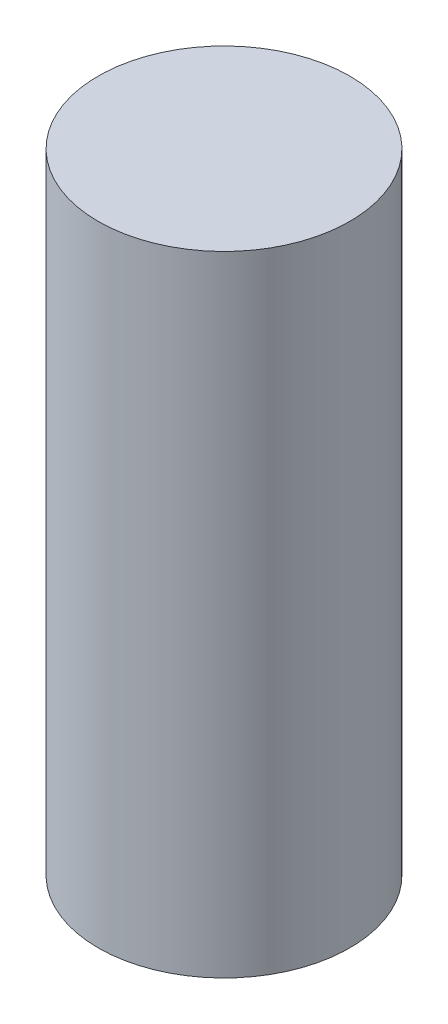
ISO-10303-21;
HEADER;
FILE_DESCRIPTION(('STEP AP214'),'2;1');
FILE_NAME('part.step','',(''),(''),'','','');
FILE_SCHEMA(('AUTOMOTIVE_DESIGN { 1 0 10303 214 1 1 1 1 }'));
ENDSEC;
DATA;
#1=APPLICATION_CONTEXT('core data for automotive mechanical design processes');
#2=APPLICATION_PROTOCOL_DEFINITION('international standard','automotive_design',2000,#1);
#3=PRODUCT_CONTEXT('',#1,'mechanical');
#4=PRODUCT('Part','Part','',(#3));
#5=PRODUCT_RELATED_PRODUCT_CATEGORY('part','',(#4));
#6=PRODUCT_DEFINITION_FORMATION('','',#4);
#7=PRODUCT_DEFINITION_CONTEXT('part definition',#1,'design');
#8=PRODUCT_DEFINITION('design','',#6,#7);
#9=PRODUCT_DEFINITION_SHAPE('','',#8);
#10=(LENGTH_UNIT() NAMED_UNIT(*) SI_UNIT(.MILLI.,.METRE.));
#11=(NAMED_UNIT(*) PLANE_ANGLE_UNIT() SI_UNIT($,.RADIAN.));
#12=(NAMED_UNIT(*) SI_UNIT($,.STERADIAN.) SOLID_ANGLE_UNIT());
#13=UNCERTAINTY_MEASURE_WITH_UNIT(LENGTH_MEASURE(1.E-05),#10,'distance_accuracy_value','');
#14=(GEOMETRIC_REPRESENTATION_CONTEXT(3) GLOBAL_UNCERTAINTY_ASSIGNED_CONTEXT((#13)) GLOBAL_UNIT_ASSIGNED_CONTEXT((#10,
#11,#12)) REPRESENTATION_CONTEXT('',''));
#15=CARTESIAN_POINT('',(0.,0.,0.));
#16=DIRECTION('',(0.,0.,1.));
#17=DIRECTION('',(1.,0.,0.));
#18=AXIS2_PLACEMENT_3D('',#15,#16,#17);
#19=CARTESIAN_POINT('',(0.,5.,0.));
#20=DIRECTION('',(0.,-1.,0.));
#21=DIRECTION('',(0.,0.,-1.));
#22=AXIS2_PLACEMENT_3D('',#19,#20,#21);
#23=CYLINDRICAL_SURFACE('',#22,1.);
#24=CARTESIAN_POINT('',(0.,5.,0.));
#25=DIRECTION('',(0.,1.,0.));
#26=DIRECTION('',(0.,0.,1.));
#27=AXIS2_PLACEMENT_3D('',#24,#25,#26);
#28=CIRCLE('',#27,1.);
#29=CARTESIAN_POINT('',(0.,5.,1.));
#30=VERTEX_POINT('',#29);
#31=EDGE_CURVE('E10',#30,#30,#28,.T.);
#32=ORIENTED_EDGE('',*,*,#31,.F.);
#33=EDGE_LOOP('',(#32));
#34=FACE_BOUND('',#33,.T.);
#35=CARTESIAN_POINT('',(0.,0.,0.));
#36=DIRECTION('',(0.,1.,0.));
#37=DIRECTION('',(0.,0.,1.));
#38=AXIS2_PLACEMENT_3D('',#35,#36,#37);
#39=CIRCLE('',#38,1.);
#40=CARTESIAN_POINT('',(0.,0.,1.));
#41=VERTEX_POINT('',#40);
#42=EDGE_CURVE('E34',#41,#41,#39,.T.);
#43=ORIENTED_EDGE('',*,*,#42,.T.);
#44=EDGE_LOOP('',(#43));
#45=FACE_BOUND('',#44,.T.);
#46=ADVANCED_FACE('F31',(#34,#45),#23,.T.);
#47=CARTESIAN_POINT('',(0.,5.,0.));
#48=DIRECTION('',(0.,1.,0.));
#49=DIRECTION('',(0.,0.,1.));
#50=AXIS2_PLACEMENT_3D('',#47,#48,#49);
#51=PLANE('',#50);
#52=ORIENTED_EDGE('',*,*,#31,.T.);
#53=EDGE_LOOP('',(#52));
#54=FACE_BOUND('',#53,.T.);
#55=ADVANCED_FACE('F46',(#54),#51,.T.);
#56=CARTESIAN_POINT('',(0.,0.,0.));
#57=DIRECTION('',(0.,1.,0.));
#58=DIRECTION('',(0.,0.,1.));
#59=AXIS2_PLACEMENT_3D('',#56,#57,#58);
#60=PLANE('',#59);
#61=ORIENTED_EDGE('',*,*,#42,.F.);
#62=EDGE_LOOP('',(#61));
#63=FACE_BOUND('',#62,.T.);
#64=ADVANCED_FACE('F44',(#63),#60,.F.);
#65=CLOSED_SHELL('',(#46,#55,#64));
#66=MANIFOLD_SOLID_BREP('B2',#65);
#67=ADVANCED_BREP_SHAPE_REPRESENTATION('',(#18,#66),#14);
#68=SHAPE_DEFINITION_REPRESENTATION(#9,#67);
ENDSEC;
END-ISO-10303-21;
